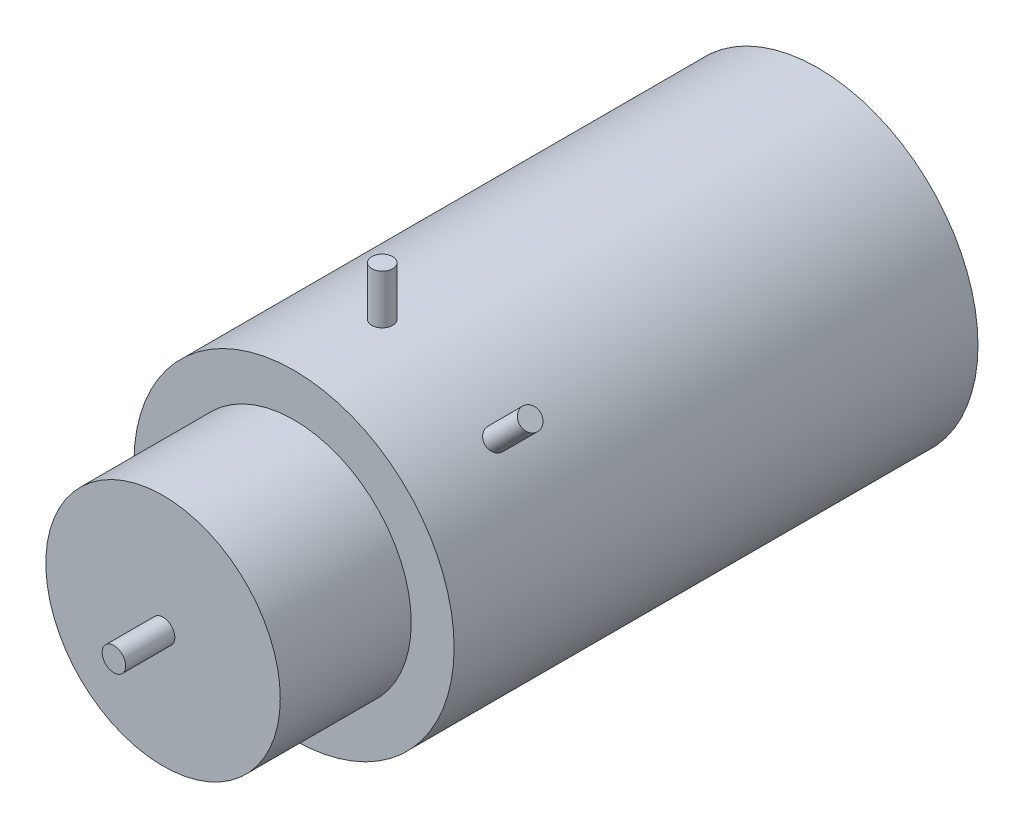
ISO-10303-21;
HEADER;
FILE_DESCRIPTION(('STEP AP214'),'2;1');
FILE_NAME('part.step','',(''),(''),'','','');
FILE_SCHEMA(('AUTOMOTIVE_DESIGN { 1 0 10303 214 1 1 1 1 }'));
ENDSEC;
DATA;
#1=APPLICATION_CONTEXT('core data for automotive mechanical design processes');
#2=APPLICATION_PROTOCOL_DEFINITION('international standard','automotive_design',2000,#1);
#3=PRODUCT_CONTEXT('',#1,'mechanical');
#4=PRODUCT('Part','Part','',(#3));
#5=PRODUCT_RELATED_PRODUCT_CATEGORY('part','',(#4));
#6=PRODUCT_DEFINITION_FORMATION('','',#4);
#7=PRODUCT_DEFINITION_CONTEXT('part definition',#1,'design');
#8=PRODUCT_DEFINITION('design','',#6,#7);
#9=PRODUCT_DEFINITION_SHAPE('','',#8);
#10=(LENGTH_UNIT() NAMED_UNIT(*) SI_UNIT(.MILLI.,.METRE.));
#11=(NAMED_UNIT(*) PLANE_ANGLE_UNIT() SI_UNIT($,.RADIAN.));
#12=(NAMED_UNIT(*) SI_UNIT($,.STERADIAN.) SOLID_ANGLE_UNIT());
#13=UNCERTAINTY_MEASURE_WITH_UNIT(LENGTH_MEASURE(1.E-05),#10,'distance_accuracy_value','');
#14=(GEOMETRIC_REPRESENTATION_CONTEXT(3) GLOBAL_UNCERTAINTY_ASSIGNED_CONTEXT((#13)) GLOBAL_UNIT_ASSIGNED_CONTEXT((#10,
#11,#12)) REPRESENTATION_CONTEXT('',''));
#15=CARTESIAN_POINT('',(0.,0.,0.));
#16=DIRECTION('',(0.,0.,1.));
#17=DIRECTION('',(1.,0.,0.));
#18=AXIS2_PLACEMENT_3D('',#15,#16,#17);
#19=CARTESIAN_POINT('',(28.691918306816,28.6919183068159,84.4873788347656));
#20=DIRECTION('',(-0.707106781186549,-0.707106781186546,0.));
#21=DIRECTION('',(0.,0.,-1.));
#22=AXIS2_PLACEMENT_3D('',#19,#20,#21);
#23=CYLINDRICAL_SURFACE('',#22,2.032);
#24=CARTESIAN_POINT('',(28.691918306816,28.6919183068159,84.4873788347656));
#25=DIRECTION('',(0.707106781186549,0.707106781186546,0.));
#26=DIRECTION('',(0.,0.,1.));
#27=AXIS2_PLACEMENT_3D('',#24,#25,#26);
#28=CIRCLE('',#27,2.032);
#29=CARTESIAN_POINT('',(28.691918306816,28.6919183068159,86.5193788347656));
#30=VERTEX_POINT('',#29);
#31=EDGE_CURVE('E11',#30,#30,#28,.T.);
#32=ORIENTED_EDGE('',*,*,#31,.F.);
#33=EDGE_LOOP('',(#32));
#34=FACE_BOUND('',#33,.T.);
#35=CARTESIAN_POINT('',(21.9567262160141,21.956726216014,84.4873788347656));
#36=DIRECTION('',(0.707106781186549,0.707106781186546,0.));
#37=DIRECTION('',(0.,0.,1.));
#38=AXIS2_PLACEMENT_3D('',#35,#36,#37);
#39=CIRCLE('',#38,2.032);
#40=CARTESIAN_POINT('',(21.9567262160141,21.956726216014,86.5193788347656));
#41=VERTEX_POINT('',#40);
#42=EDGE_CURVE('E55',#41,#41,#39,.T.);
#43=ORIENTED_EDGE('',*,*,#42,.T.);
#44=EDGE_LOOP('',(#43));
#45=FACE_BOUND('',#44,.T.);
#46=ADVANCED_FACE('F52',(#34,#45),#23,.T.);
#47=CARTESIAN_POINT('',(28.691918306816,28.6919183068159,84.4873788347656));
#48=DIRECTION('',(0.707106781186549,0.707106781186546,0.));
#49=DIRECTION('',(0.,0.,1.));
#50=AXIS2_PLACEMENT_3D('',#47,#48,#49);
#51=PLANE('',#50);
#52=ORIENTED_EDGE('',*,*,#31,.T.);
#53=EDGE_LOOP('',(#52));
#54=FACE_BOUND('',#53,.T.);
#55=ADVANCED_FACE('F67',(#54),#51,.T.);
#56=CARTESIAN_POINT('',(21.9567262160141,21.956726216014,84.4873788347656));
#57=DIRECTION('',(0.707106781186549,0.707106781186546,0.));
#58=DIRECTION('',(0.,0.,1.));
#59=AXIS2_PLACEMENT_3D('',#56,#57,#58);
#60=PLANE('',#59);
#61=ORIENTED_EDGE('',*,*,#42,.F.);
#62=EDGE_LOOP('',(#61));
#63=FACE_BOUND('',#62,.T.);
#64=ADVANCED_FACE('F65',(#63),#60,.F.);
#65=CLOSED_SHELL('',(#46,#55,#64));
#66=MANIFOLD_SOLID_BREP('B2',#65);
#67=CARTESIAN_POINT('',(0.,40.5765,84.4873788347656));
#68=DIRECTION('',(0.,-1.,0.));
#69=DIRECTION('',(0.,0.,-1.));
#70=AXIS2_PLACEMENT_3D('',#67,#68,#69);
#71=CYLINDRICAL_SURFACE('',#70,2.032);
#72=CARTESIAN_POINT('',(0.,40.5765,84.4873788347656));
#73=DIRECTION('',(0.,1.,0.));
#74=DIRECTION('',(0.,0.,1.));
#75=AXIS2_PLACEMENT_3D('',#72,#73,#74);
#76=CIRCLE('',#75,2.032);
#77=CARTESIAN_POINT('',(0.,40.5765,86.5193788347656));
#78=VERTEX_POINT('',#77);
#79=EDGE_CURVE('E51',#78,#78,#76,.T.);
#80=ORIENTED_EDGE('',*,*,#79,.F.);
#81=EDGE_LOOP('',(#80));
#82=FACE_BOUND('',#81,.T.);
#83=CARTESIAN_POINT('',(0.,31.0515,84.4873788347656));
#84=DIRECTION('',(0.,1.,0.));
#85=DIRECTION('',(0.,0.,1.));
#86=AXIS2_PLACEMENT_3D('',#83,#84,#85);
#87=CIRCLE('',#86,2.032);
#88=CARTESIAN_POINT('',(0.,31.0515,86.5193788347656));
#89=VERTEX_POINT('',#88);
#90=EDGE_CURVE('E103',#89,#89,#87,.T.);
#91=ORIENTED_EDGE('',*,*,#90,.T.);
#92=EDGE_LOOP('',(#91));
#93=FACE_BOUND('',#92,.T.);
#94=ADVANCED_FACE('F100',(#82,#93),#71,.T.);
#95=CARTESIAN_POINT('',(0.,40.5765,84.4873788347656));
#96=DIRECTION('',(0.,1.,0.));
#97=DIRECTION('',(0.,0.,1.));
#98=AXIS2_PLACEMENT_3D('',#95,#96,#97);
#99=PLANE('',#98);
#100=ORIENTED_EDGE('',*,*,#79,.T.);
#101=EDGE_LOOP('',(#100));
#102=FACE_BOUND('',#101,.T.);
#103=ADVANCED_FACE('F115',(#102),#99,.T.);
#104=CARTESIAN_POINT('',(0.,31.0515,84.4873788347656));
#105=DIRECTION('',(0.,1.,0.));
#106=DIRECTION('',(0.,0.,1.));
#107=AXIS2_PLACEMENT_3D('',#104,#105,#106);
#108=PLANE('',#107);
#109=ORIENTED_EDGE('',*,*,#90,.F.);
#110=EDGE_LOOP('',(#109));
#111=FACE_BOUND('',#110,.T.);
#112=ADVANCED_FACE('F113',(#111),#108,.F.);
#113=CLOSED_SHELL('',(#94,#103,#112));
#114=MANIFOLD_SOLID_BREP('B6',#113);
#115=CARTESIAN_POINT('',(0.,0.,101.6));
#116=DIRECTION('',(0.,0.,-1.));
#117=DIRECTION('',(-1.,0.,0.));
#118=AXIS2_PLACEMENT_3D('',#115,#116,#117);
#119=CYLINDRICAL_SURFACE('',#118,31.0515);
#120=CARTESIAN_POINT('',(0.,0.,101.6));
#121=DIRECTION('',(0.,0.,1.));
#122=DIRECTION('',(1.,0.,0.));
#123=AXIS2_PLACEMENT_3D('',#120,#121,#122);
#124=CIRCLE('',#123,31.0515);
#125=CARTESIAN_POINT('',(31.0515,0.,101.6));
#126=VERTEX_POINT('',#125);
#127=EDGE_CURVE('E149',#126,#126,#124,.T.);
#128=ORIENTED_EDGE('',*,*,#127,.F.);
#129=EDGE_LOOP('',(#128));
#130=FACE_BOUND('',#129,.T.);
#131=CARTESIAN_POINT('',(0.,0.,0.));
#132=DIRECTION('',(0.,0.,1.));
#133=DIRECTION('',(1.,0.,0.));
#134=AXIS2_PLACEMENT_3D('',#131,#132,#133);
#135=CIRCLE('',#134,31.0515);
#136=CARTESIAN_POINT('',(31.0515,0.,0.));
#137=VERTEX_POINT('',#136);
#138=EDGE_CURVE('E144',#137,#137,#135,.T.);
#139=ORIENTED_EDGE('',*,*,#138,.T.);
#140=EDGE_LOOP('',(#139));
#141=FACE_BOUND('',#140,.T.);
#142=ADVANCED_FACE('F141',(#130,#141),#119,.T.);
#143=CARTESIAN_POINT('',(0.,0.,101.6));
#144=DIRECTION('',(0.,0.,1.));
#145=DIRECTION('',(1.,0.,0.));
#146=AXIS2_PLACEMENT_3D('',#143,#144,#145);
#147=PLANE('',#146);
#148=CARTESIAN_POINT('',(0.,0.,101.6));
#149=DIRECTION('',(0.,0.,1.));
#150=DIRECTION('',(1.,0.,0.));
#151=AXIS2_PLACEMENT_3D('',#148,#149,#150);
#152=CIRCLE('',#151,22.733);
#153=CARTESIAN_POINT('',(22.733,0.,101.6));
#154=VERTEX_POINT('',#153);
#155=EDGE_CURVE('E99',#154,#154,#152,.T.);
#156=ORIENTED_EDGE('',*,*,#155,.F.);
#157=EDGE_LOOP('',(#156));
#158=FACE_BOUND('',#157,.T.);
#159=ORIENTED_EDGE('',*,*,#127,.T.);
#160=EDGE_LOOP('',(#159));
#161=FACE_BOUND('',#160,.T.);
#162=ADVANCED_FACE('F191',(#158,#161),#147,.T.);
#163=CARTESIAN_POINT('',(0.,0.,0.));
#164=DIRECTION('',(0.,0.,1.));
#165=DIRECTION('',(1.,0.,0.));
#166=AXIS2_PLACEMENT_3D('',#163,#164,#165);
#167=PLANE('',#166);
#168=ORIENTED_EDGE('',*,*,#138,.F.);
#169=EDGE_LOOP('',(#168));
#170=FACE_BOUND('',#169,.T.);
#171=ADVANCED_FACE('F185',(#170),#167,.F.);
#172=CARTESIAN_POINT('',(0.,0.,127.));
#173=DIRECTION('',(0.,0.,-1.));
#174=DIRECTION('',(-1.,0.,0.));
#175=AXIS2_PLACEMENT_3D('',#172,#173,#174);
#176=CYLINDRICAL_SURFACE('',#175,22.733);
#177=CARTESIAN_POINT('',(0.,0.,127.));
#178=DIRECTION('',(0.,0.,1.));
#179=DIRECTION('',(1.,0.,0.));
#180=AXIS2_PLACEMENT_3D('',#177,#178,#179);
#181=CIRCLE('',#180,22.733);
#182=CARTESIAN_POINT('',(22.733,0.,127.));
#183=VERTEX_POINT('',#182);
#184=EDGE_CURVE('E156',#183,#183,#181,.T.);
#185=ORIENTED_EDGE('',*,*,#184,.F.);
#186=EDGE_LOOP('',(#185));
#187=FACE_BOUND('',#186,.T.);
#188=ORIENTED_EDGE('',*,*,#155,.T.);
#189=EDGE_LOOP('',(#188));
#190=FACE_BOUND('',#189,.T.);
#191=ADVANCED_FACE('F180',(#187,#190),#176,.T.);
#192=CARTESIAN_POINT('',(0.,0.,127.));
#193=DIRECTION('',(0.,0.,1.));
#194=DIRECTION('',(1.,0.,0.));
#195=AXIS2_PLACEMENT_3D('',#192,#193,#194);
#196=PLANE('',#195);
#197=CARTESIAN_POINT('',(0.,0.,127.));
#198=DIRECTION('',(0.,0.,1.));
#199=DIRECTION('',(1.,0.,0.));
#200=AXIS2_PLACEMENT_3D('',#197,#198,#199);
#201=CIRCLE('',#200,2.286);
#202=CARTESIAN_POINT('',(2.286,0.,127.));
#203=VERTEX_POINT('',#202);
#204=EDGE_CURVE('E161',#203,#203,#201,.T.);
#205=ORIENTED_EDGE('',*,*,#204,.F.);
#206=EDGE_LOOP('',(#205));
#207=FACE_BOUND('',#206,.T.);
#208=ORIENTED_EDGE('',*,*,#184,.T.);
#209=EDGE_LOOP('',(#208));
#210=FACE_BOUND('',#209,.T.);
#211=ADVANCED_FACE('F174',(#207,#210),#196,.T.);
#212=CARTESIAN_POINT('',(0.,0.,136.525));
#213=DIRECTION('',(0.,0.,-1.));
#214=DIRECTION('',(-1.,0.,0.));
#215=AXIS2_PLACEMENT_3D('',#212,#213,#214);
#216=CYLINDRICAL_SURFACE('',#215,2.286);
#217=CARTESIAN_POINT('',(0.,0.,136.525));
#218=DIRECTION('',(0.,0.,1.));
#219=DIRECTION('',(1.,0.,0.));
#220=AXIS2_PLACEMENT_3D('',#217,#218,#219);
#221=CIRCLE('',#220,2.286);
#222=CARTESIAN_POINT('',(2.286,0.,136.525));
#223=VERTEX_POINT('',#222);
#224=EDGE_CURVE('E160',#223,#223,#221,.T.);
#225=ORIENTED_EDGE('',*,*,#224,.F.);
#226=EDGE_LOOP('',(#225));
#227=FACE_BOUND('',#226,.T.);
#228=ORIENTED_EDGE('',*,*,#204,.T.);
#229=EDGE_LOOP('',(#228));
#230=FACE_BOUND('',#229,.T.);
#231=ADVANCED_FACE('F171',(#227,#230),#216,.T.);
#232=CARTESIAN_POINT('',(0.,0.,136.525));
#233=DIRECTION('',(0.,0.,1.));
#234=DIRECTION('',(1.,0.,0.));
#235=AXIS2_PLACEMENT_3D('',#232,#233,#234);
#236=PLANE('',#235);
#237=ORIENTED_EDGE('',*,*,#224,.T.);
#238=EDGE_LOOP('',(#237));
#239=FACE_BOUND('',#238,.T.);
#240=ADVANCED_FACE('F169',(#239),#236,.T.);
#241=CLOSED_SHELL('',(#142,#162,#171,#191,#211,#231,#240));
#242=MANIFOLD_SOLID_BREP('B46',#241);
#243=ADVANCED_BREP_SHAPE_REPRESENTATION('',(#18,#66,#114,#242),#14);
#244=SHAPE_DEFINITION_REPRESENTATION(#9,#243);
ENDSEC;
END-ISO-10303-21;
